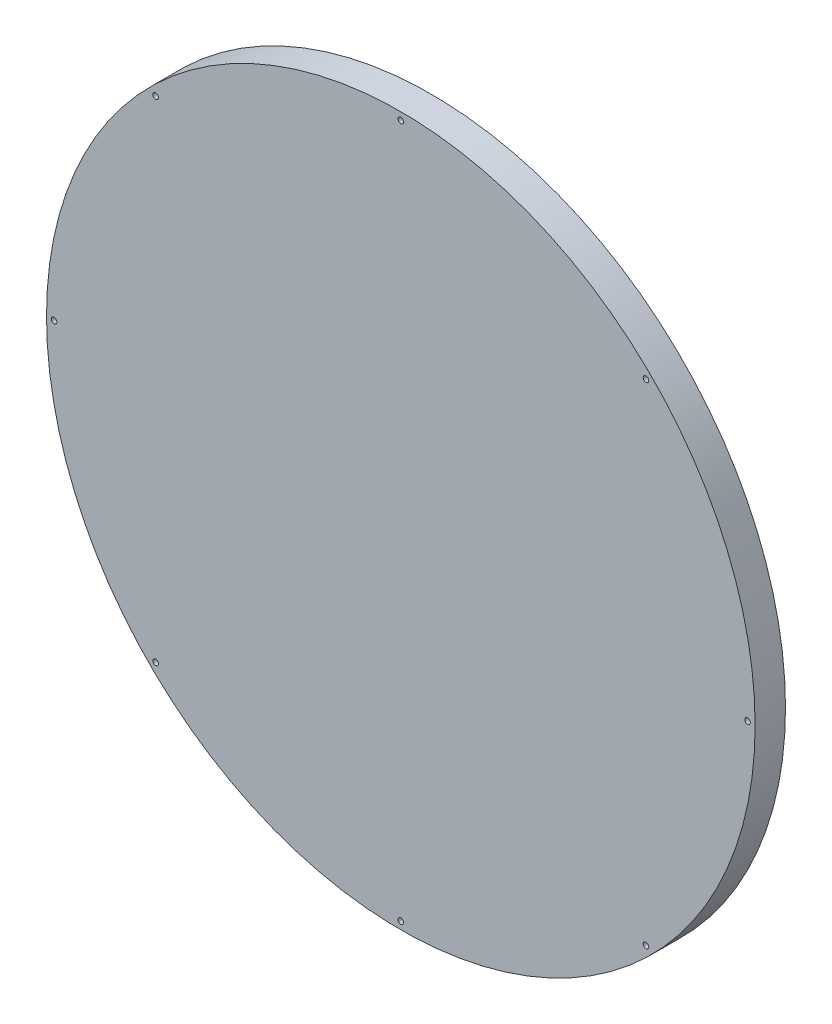
ISO-10303-21;
HEADER;
FILE_DESCRIPTION(('STEP AP214'),'2;1');
FILE_NAME('part.step','',(''),(''),'','','');
FILE_SCHEMA(('AUTOMOTIVE_DESIGN { 1 0 10303 214 1 1 1 1 }'));
ENDSEC;
DATA;
#1=APPLICATION_CONTEXT('core data for automotive mechanical design processes');
#2=APPLICATION_PROTOCOL_DEFINITION('international standard','automotive_design',2000,#1);
#3=PRODUCT_CONTEXT('',#1,'mechanical');
#4=PRODUCT('Part','Part','',(#3));
#5=PRODUCT_RELATED_PRODUCT_CATEGORY('part','',(#4));
#6=PRODUCT_DEFINITION_FORMATION('','',#4);
#7=PRODUCT_DEFINITION_CONTEXT('part definition',#1,'design');
#8=PRODUCT_DEFINITION('design','',#6,#7);
#9=PRODUCT_DEFINITION_SHAPE('','',#8);
#10=(LENGTH_UNIT() NAMED_UNIT(*) SI_UNIT(.MILLI.,.METRE.));
#11=(NAMED_UNIT(*) PLANE_ANGLE_UNIT() SI_UNIT($,.RADIAN.));
#12=(NAMED_UNIT(*) SI_UNIT($,.STERADIAN.) SOLID_ANGLE_UNIT());
#13=UNCERTAINTY_MEASURE_WITH_UNIT(LENGTH_MEASURE(1.E-05),#10,'distance_accuracy_value','');
#14=(GEOMETRIC_REPRESENTATION_CONTEXT(3) GLOBAL_UNCERTAINTY_ASSIGNED_CONTEXT((#13)) GLOBAL_UNIT_ASSIGNED_CONTEXT((#10,
#11,#12)) REPRESENTATION_CONTEXT('',''));
#15=CARTESIAN_POINT('',(0.,0.,0.));
#16=DIRECTION('',(0.,0.,1.));
#17=DIRECTION('',(1.,0.,0.));
#18=AXIS2_PLACEMENT_3D('',#15,#16,#17);
#19=CARTESIAN_POINT('',(0.,0.,12.));
#20=DIRECTION('',(0.,0.,-1.));
#21=DIRECTION('',(-1.,0.,0.));
#22=AXIS2_PLACEMENT_3D('',#19,#20,#21);
#23=CYLINDRICAL_SURFACE('',#22,140.);
#24=CARTESIAN_POINT('',(0.,0.,12.));
#25=DIRECTION('',(0.,0.,1.));
#26=DIRECTION('',(1.,0.,0.));
#27=AXIS2_PLACEMENT_3D('',#24,#25,#26);
#28=CIRCLE('',#27,140.);
#29=CARTESIAN_POINT('',(140.,0.,12.));
#30=VERTEX_POINT('',#29);
#31=EDGE_CURVE('E10',#30,#30,#28,.T.);
#32=ORIENTED_EDGE('',*,*,#31,.F.);
#33=EDGE_LOOP('',(#32));
#34=FACE_BOUND('',#33,.T.);
#35=CARTESIAN_POINT('',(0.,0.,0.));
#36=DIRECTION('',(0.,0.,1.));
#37=DIRECTION('',(1.,0.,0.));
#38=AXIS2_PLACEMENT_3D('',#35,#36,#37);
#39=CIRCLE('',#38,140.);
#40=CARTESIAN_POINT('',(140.,0.,0.));
#41=VERTEX_POINT('',#40);
#42=EDGE_CURVE('E40',#41,#41,#39,.T.);
#43=ORIENTED_EDGE('',*,*,#42,.T.);
#44=EDGE_LOOP('',(#43));
#45=FACE_BOUND('',#44,.T.);
#46=ADVANCED_FACE('F37',(#34,#45),#23,.T.);
#47=CARTESIAN_POINT('',(0.,0.,12.));
#48=DIRECTION('',(0.,0.,1.));
#49=DIRECTION('',(1.,0.,0.));
#50=AXIS2_PLACEMENT_3D('',#47,#48,#49);
#51=PLANE('',#50);
#52=CARTESIAN_POINT('',(0.,137.,12.));
#53=DIRECTION('',(0.,0.,-1.));
#54=DIRECTION('',(-1.,0.,0.));
#55=AXIS2_PLACEMENT_3D('',#52,#53,#54);
#56=CIRCLE('',#55,1.1);
#57=CARTESIAN_POINT('',(-1.1,137.,12.));
#58=VERTEX_POINT('',#57);
#59=EDGE_CURVE('E111',#58,#58,#56,.T.);
#60=ORIENTED_EDGE('',*,*,#59,.T.);
#61=EDGE_LOOP('',(#60));
#62=FACE_BOUND('',#61,.T.);
#63=CARTESIAN_POINT('',(-137.,0.,12.));
#64=DIRECTION('',(0.,0.,-1.));
#65=DIRECTION('',(-1.,0.,0.));
#66=AXIS2_PLACEMENT_3D('',#63,#64,#65);
#67=CIRCLE('',#66,1.09999999999999);
#68=CARTESIAN_POINT('',(-138.1,0.,12.));
#69=VERTEX_POINT('',#68);
#70=EDGE_CURVE('E102',#69,#69,#67,.T.);
#71=ORIENTED_EDGE('',*,*,#70,.T.);
#72=EDGE_LOOP('',(#71));
#73=FACE_BOUND('',#72,.T.);
#74=CARTESIAN_POINT('',(0.,-137.,12.));
#75=DIRECTION('',(0.,0.,-1.));
#76=DIRECTION('',(-1.,0.,0.));
#77=AXIS2_PLACEMENT_3D('',#74,#75,#76);
#78=CIRCLE('',#77,1.1);
#79=CARTESIAN_POINT('',(-1.1,-137.,12.));
#80=VERTEX_POINT('',#79);
#81=EDGE_CURVE('E93',#80,#80,#78,.T.);
#82=ORIENTED_EDGE('',*,*,#81,.T.);
#83=EDGE_LOOP('',(#82));
#84=FACE_BOUND('',#83,.T.);
#85=CARTESIAN_POINT('',(137.,0.,12.));
#86=DIRECTION('',(0.,0.,-1.));
#87=DIRECTION('',(-1.,0.,0.));
#88=AXIS2_PLACEMENT_3D('',#85,#86,#87);
#89=CIRCLE('',#88,1.09999999999999);
#90=CARTESIAN_POINT('',(135.9,0.,12.));
#91=VERTEX_POINT('',#90);
#92=EDGE_CURVE('E84',#91,#91,#89,.T.);
#93=ORIENTED_EDGE('',*,*,#92,.T.);
#94=EDGE_LOOP('',(#93));
#95=FACE_BOUND('',#94,.T.);
#96=CARTESIAN_POINT('',(96.874,96.874,12.));
#97=DIRECTION('',(0.,0.,-1.));
#98=DIRECTION('',(-1.,0.,0.));
#99=AXIS2_PLACEMENT_3D('',#96,#97,#98);
#100=CIRCLE('',#99,1.1);
#101=CARTESIAN_POINT('',(95.774,96.874,12.));
#102=VERTEX_POINT('',#101);
#103=EDGE_CURVE('E75',#102,#102,#100,.T.);
#104=ORIENTED_EDGE('',*,*,#103,.T.);
#105=EDGE_LOOP('',(#104));
#106=FACE_BOUND('',#105,.T.);
#107=CARTESIAN_POINT('',(-96.874,96.874,12.));
#108=DIRECTION('',(0.,0.,-1.));
#109=DIRECTION('',(-1.,0.,0.));
#110=AXIS2_PLACEMENT_3D('',#107,#108,#109);
#111=CIRCLE('',#110,1.1);
#112=CARTESIAN_POINT('',(-97.974,96.874,12.));
#113=VERTEX_POINT('',#112);
#114=EDGE_CURVE('E66',#113,#113,#111,.T.);
#115=ORIENTED_EDGE('',*,*,#114,.T.);
#116=EDGE_LOOP('',(#115));
#117=FACE_BOUND('',#116,.T.);
#118=CARTESIAN_POINT('',(-96.874,-96.874,12.));
#119=DIRECTION('',(0.,0.,-1.));
#120=DIRECTION('',(-1.,0.,0.));
#121=AXIS2_PLACEMENT_3D('',#118,#119,#120);
#122=CIRCLE('',#121,1.1);
#123=CARTESIAN_POINT('',(-97.974,-96.874,12.));
#124=VERTEX_POINT('',#123);
#125=EDGE_CURVE('E57',#124,#124,#122,.T.);
#126=ORIENTED_EDGE('',*,*,#125,.T.);
#127=EDGE_LOOP('',(#126));
#128=FACE_BOUND('',#127,.T.);
#129=CARTESIAN_POINT('',(96.874,-96.874,12.));
#130=DIRECTION('',(0.,0.,-1.));
#131=DIRECTION('',(-1.,0.,0.));
#132=AXIS2_PLACEMENT_3D('',#129,#130,#131);
#133=CIRCLE('',#132,1.1);
#134=CARTESIAN_POINT('',(95.774,-96.874,12.));
#135=VERTEX_POINT('',#134);
#136=EDGE_CURVE('E47',#135,#135,#133,.T.);
#137=ORIENTED_EDGE('',*,*,#136,.T.);
#138=EDGE_LOOP('',(#137));
#139=FACE_BOUND('',#138,.T.);
#140=ORIENTED_EDGE('',*,*,#31,.T.);
#141=EDGE_LOOP('',(#140));
#142=FACE_BOUND('',#141,.T.);
#143=ADVANCED_FACE('F127',(#62,#73,#84,#95,#106,#117,#128,#139,#142),#51,.T.);
#144=CARTESIAN_POINT('',(0.,0.,0.));
#145=DIRECTION('',(0.,0.,1.));
#146=DIRECTION('',(1.,0.,0.));
#147=AXIS2_PLACEMENT_3D('',#144,#145,#146);
#148=PLANE('',#147);
#149=CARTESIAN_POINT('',(0.,137.,0.));
#150=DIRECTION('',(0.,0.,-1.));
#151=DIRECTION('',(-1.,0.,0.));
#152=AXIS2_PLACEMENT_3D('',#149,#150,#151);
#153=CIRCLE('',#152,2.2);
#154=CARTESIAN_POINT('',(-2.2,137.,0.));
#155=VERTEX_POINT('',#154);
#156=EDGE_CURVE('E117',#155,#155,#153,.T.);
#157=ORIENTED_EDGE('',*,*,#156,.F.);
#158=EDGE_LOOP('',(#157));
#159=FACE_BOUND('',#158,.T.);
#160=CARTESIAN_POINT('',(-137.,0.,0.));
#161=DIRECTION('',(0.,0.,-1.));
#162=DIRECTION('',(-1.,0.,0.));
#163=AXIS2_PLACEMENT_3D('',#160,#161,#162);
#164=CIRCLE('',#163,2.20000000000001);
#165=CARTESIAN_POINT('',(-139.2,0.,0.));
#166=VERTEX_POINT('',#165);
#167=EDGE_CURVE('E108',#166,#166,#164,.T.);
#168=ORIENTED_EDGE('',*,*,#167,.F.);
#169=EDGE_LOOP('',(#168));
#170=FACE_BOUND('',#169,.T.);
#171=CARTESIAN_POINT('',(0.,-137.,0.));
#172=DIRECTION('',(0.,0.,-1.));
#173=DIRECTION('',(-1.,0.,0.));
#174=AXIS2_PLACEMENT_3D('',#171,#172,#173);
#175=CIRCLE('',#174,2.2);
#176=CARTESIAN_POINT('',(-2.2,-137.,0.));
#177=VERTEX_POINT('',#176);
#178=EDGE_CURVE('E99',#177,#177,#175,.T.);
#179=ORIENTED_EDGE('',*,*,#178,.F.);
#180=EDGE_LOOP('',(#179));
#181=FACE_BOUND('',#180,.T.);
#182=CARTESIAN_POINT('',(137.,0.,0.));
#183=DIRECTION('',(0.,0.,-1.));
#184=DIRECTION('',(-1.,0.,0.));
#185=AXIS2_PLACEMENT_3D('',#182,#183,#184);
#186=CIRCLE('',#185,2.20000000000001);
#187=CARTESIAN_POINT('',(134.8,0.,0.));
#188=VERTEX_POINT('',#187);
#189=EDGE_CURVE('E90',#188,#188,#186,.T.);
#190=ORIENTED_EDGE('',*,*,#189,.F.);
#191=EDGE_LOOP('',(#190));
#192=FACE_BOUND('',#191,.T.);
#193=CARTESIAN_POINT('',(96.874,96.874,0.));
#194=DIRECTION('',(0.,0.,-1.));
#195=DIRECTION('',(-1.,0.,0.));
#196=AXIS2_PLACEMENT_3D('',#193,#194,#195);
#197=CIRCLE('',#196,2.19999999999999);
#198=CARTESIAN_POINT('',(94.674,96.874,0.));
#199=VERTEX_POINT('',#198);
#200=EDGE_CURVE('E81',#199,#199,#197,.T.);
#201=ORIENTED_EDGE('',*,*,#200,.F.);
#202=EDGE_LOOP('',(#201));
#203=FACE_BOUND('',#202,.T.);
#204=CARTESIAN_POINT('',(-96.874,96.874,0.));
#205=DIRECTION('',(0.,0.,-1.));
#206=DIRECTION('',(-1.,0.,0.));
#207=AXIS2_PLACEMENT_3D('',#204,#205,#206);
#208=CIRCLE('',#207,2.19999999999999);
#209=CARTESIAN_POINT('',(-99.074,96.874,0.));
#210=VERTEX_POINT('',#209);
#211=EDGE_CURVE('E72',#210,#210,#208,.T.);
#212=ORIENTED_EDGE('',*,*,#211,.F.);
#213=EDGE_LOOP('',(#212));
#214=FACE_BOUND('',#213,.T.);
#215=CARTESIAN_POINT('',(-96.874,-96.874,0.));
#216=DIRECTION('',(0.,0.,-1.));
#217=DIRECTION('',(-1.,0.,0.));
#218=AXIS2_PLACEMENT_3D('',#215,#216,#217);
#219=CIRCLE('',#218,2.19999999999999);
#220=CARTESIAN_POINT('',(-99.074,-96.874,0.));
#221=VERTEX_POINT('',#220);
#222=EDGE_CURVE('E63',#221,#221,#219,.T.);
#223=ORIENTED_EDGE('',*,*,#222,.F.);
#224=EDGE_LOOP('',(#223));
#225=FACE_BOUND('',#224,.T.);
#226=CARTESIAN_POINT('',(96.874,-96.874,0.));
#227=DIRECTION('',(0.,0.,-1.));
#228=DIRECTION('',(-1.,0.,0.));
#229=AXIS2_PLACEMENT_3D('',#226,#227,#228);
#230=CIRCLE('',#229,2.19999999999999);
#231=CARTESIAN_POINT('',(94.674,-96.874,0.));
#232=VERTEX_POINT('',#231);
#233=EDGE_CURVE('E54',#232,#232,#230,.T.);
#234=ORIENTED_EDGE('',*,*,#233,.F.);
#235=EDGE_LOOP('',(#234));
#236=FACE_BOUND('',#235,.T.);
#237=ORIENTED_EDGE('',*,*,#42,.F.);
#238=EDGE_LOOP('',(#237));
#239=FACE_BOUND('',#238,.T.);
#240=ADVANCED_FACE('F123',(#159,#170,#181,#192,#203,#214,#225,#236,#239),#148,.F.);
#241=CARTESIAN_POINT('',(96.874,-96.874,0.));
#242=DIRECTION('',(0.,0.,-1.));
#243=DIRECTION('',(-1.,0.,0.));
#244=AXIS2_PLACEMENT_3D('',#241,#242,#243);
#245=CYLINDRICAL_SURFACE('',#244,1.1);
#246=ORIENTED_EDGE('',*,*,#136,.F.);
#247=EDGE_LOOP('',(#246));
#248=FACE_BOUND('',#247,.T.);
#249=CARTESIAN_POINT('',(96.874,-96.874,1.1));
#250=DIRECTION('',(0.,0.,-1.));
#251=DIRECTION('',(-1.,0.,0.));
#252=AXIS2_PLACEMENT_3D('',#249,#250,#251);
#253=CIRCLE('',#252,1.1);
#254=CARTESIAN_POINT('',(95.774,-96.874,1.1));
#255=VERTEX_POINT('',#254);
#256=EDGE_CURVE('E51',#255,#255,#253,.T.);
#257=ORIENTED_EDGE('',*,*,#256,.T.);
#258=EDGE_LOOP('',(#257));
#259=FACE_BOUND('',#258,.T.);
#260=ADVANCED_FACE('F126',(#248,#259),#245,.F.);
#261=CARTESIAN_POINT('',(96.874,-96.874,0.));
#262=DIRECTION('',(0.,0.,-1.));
#263=DIRECTION('',(-1.,0.,0.));
#264=AXIS2_PLACEMENT_3D('',#261,#262,#263);
#265=CONICAL_SURFACE('',#264,2.19999999999999,0.785398163397443);
#266=ORIENTED_EDGE('',*,*,#256,.F.);
#267=EDGE_LOOP('',(#266));
#268=FACE_BOUND('',#267,.T.);
#269=ORIENTED_EDGE('',*,*,#233,.T.);
#270=EDGE_LOOP('',(#269));
#271=FACE_BOUND('',#270,.T.);
#272=ADVANCED_FACE('F157',(#268,#271),#265,.F.);
#273=CARTESIAN_POINT('',(-96.874,-96.874,0.));
#274=DIRECTION('',(0.,0.,-1.));
#275=DIRECTION('',(-1.,0.,0.));
#276=AXIS2_PLACEMENT_3D('',#273,#274,#275);
#277=CYLINDRICAL_SURFACE('',#276,1.1);
#278=ORIENTED_EDGE('',*,*,#125,.F.);
#279=EDGE_LOOP('',(#278));
#280=FACE_BOUND('',#279,.T.);
#281=CARTESIAN_POINT('',(-96.874,-96.874,1.1));
#282=DIRECTION('',(0.,0.,-1.));
#283=DIRECTION('',(-1.,0.,0.));
#284=AXIS2_PLACEMENT_3D('',#281,#282,#283);
#285=CIRCLE('',#284,1.1);
#286=CARTESIAN_POINT('',(-97.974,-96.874,1.1));
#287=VERTEX_POINT('',#286);
#288=EDGE_CURVE('E60',#287,#287,#285,.T.);
#289=ORIENTED_EDGE('',*,*,#288,.T.);
#290=EDGE_LOOP('',(#289));
#291=FACE_BOUND('',#290,.T.);
#292=ADVANCED_FACE('F161',(#280,#291),#277,.F.);
#293=CARTESIAN_POINT('',(-96.874,-96.874,0.));
#294=DIRECTION('',(0.,0.,-1.));
#295=DIRECTION('',(-1.,0.,0.));
#296=AXIS2_PLACEMENT_3D('',#293,#294,#295);
#297=CONICAL_SURFACE('',#296,2.19999999999999,0.785398163397443);
#298=ORIENTED_EDGE('',*,*,#288,.F.);
#299=EDGE_LOOP('',(#298));
#300=FACE_BOUND('',#299,.T.);
#301=ORIENTED_EDGE('',*,*,#222,.T.);
#302=EDGE_LOOP('',(#301));
#303=FACE_BOUND('',#302,.T.);
#304=ADVANCED_FACE('F165',(#300,#303),#297,.F.);
#305=CARTESIAN_POINT('',(-96.874,96.874,0.));
#306=DIRECTION('',(0.,0.,-1.));
#307=DIRECTION('',(-1.,0.,0.));
#308=AXIS2_PLACEMENT_3D('',#305,#306,#307);
#309=CYLINDRICAL_SURFACE('',#308,1.1);
#310=ORIENTED_EDGE('',*,*,#114,.F.);
#311=EDGE_LOOP('',(#310));
#312=FACE_BOUND('',#311,.T.);
#313=CARTESIAN_POINT('',(-96.874,96.874,1.1));
#314=DIRECTION('',(0.,0.,-1.));
#315=DIRECTION('',(-1.,0.,0.));
#316=AXIS2_PLACEMENT_3D('',#313,#314,#315);
#317=CIRCLE('',#316,1.1);
#318=CARTESIAN_POINT('',(-97.974,96.874,1.1));
#319=VERTEX_POINT('',#318);
#320=EDGE_CURVE('E69',#319,#319,#317,.T.);
#321=ORIENTED_EDGE('',*,*,#320,.T.);
#322=EDGE_LOOP('',(#321));
#323=FACE_BOUND('',#322,.T.);
#324=ADVANCED_FACE('F169',(#312,#323),#309,.F.);
#325=CARTESIAN_POINT('',(-96.874,96.874,0.));
#326=DIRECTION('',(0.,0.,-1.));
#327=DIRECTION('',(-1.,0.,0.));
#328=AXIS2_PLACEMENT_3D('',#325,#326,#327);
#329=CONICAL_SURFACE('',#328,2.19999999999999,0.785398163397443);
#330=ORIENTED_EDGE('',*,*,#320,.F.);
#331=EDGE_LOOP('',(#330));
#332=FACE_BOUND('',#331,.T.);
#333=ORIENTED_EDGE('',*,*,#211,.T.);
#334=EDGE_LOOP('',(#333));
#335=FACE_BOUND('',#334,.T.);
#336=ADVANCED_FACE('F173',(#332,#335),#329,.F.);
#337=CARTESIAN_POINT('',(96.874,96.874,0.));
#338=DIRECTION('',(0.,0.,-1.));
#339=DIRECTION('',(-1.,0.,0.));
#340=AXIS2_PLACEMENT_3D('',#337,#338,#339);
#341=CYLINDRICAL_SURFACE('',#340,1.1);
#342=ORIENTED_EDGE('',*,*,#103,.F.);
#343=EDGE_LOOP('',(#342));
#344=FACE_BOUND('',#343,.T.);
#345=CARTESIAN_POINT('',(96.874,96.874,1.1));
#346=DIRECTION('',(0.,0.,-1.));
#347=DIRECTION('',(-1.,0.,0.));
#348=AXIS2_PLACEMENT_3D('',#345,#346,#347);
#349=CIRCLE('',#348,1.1);
#350=CARTESIAN_POINT('',(95.774,96.874,1.1));
#351=VERTEX_POINT('',#350);
#352=EDGE_CURVE('E78',#351,#351,#349,.T.);
#353=ORIENTED_EDGE('',*,*,#352,.T.);
#354=EDGE_LOOP('',(#353));
#355=FACE_BOUND('',#354,.T.);
#356=ADVANCED_FACE('F177',(#344,#355),#341,.F.);
#357=CARTESIAN_POINT('',(96.874,96.874,0.));
#358=DIRECTION('',(0.,0.,-1.));
#359=DIRECTION('',(-1.,0.,0.));
#360=AXIS2_PLACEMENT_3D('',#357,#358,#359);
#361=CONICAL_SURFACE('',#360,2.19999999999999,0.785398163397443);
#362=ORIENTED_EDGE('',*,*,#352,.F.);
#363=EDGE_LOOP('',(#362));
#364=FACE_BOUND('',#363,.T.);
#365=ORIENTED_EDGE('',*,*,#200,.T.);
#366=EDGE_LOOP('',(#365));
#367=FACE_BOUND('',#366,.T.);
#368=ADVANCED_FACE('F181',(#364,#367),#361,.F.);
#369=CARTESIAN_POINT('',(137.,0.,0.));
#370=DIRECTION('',(0.,0.,-1.));
#371=DIRECTION('',(-1.,0.,0.));
#372=AXIS2_PLACEMENT_3D('',#369,#370,#371);
#373=CYLINDRICAL_SURFACE('',#372,1.09999999999999);
#374=ORIENTED_EDGE('',*,*,#92,.F.);
#375=EDGE_LOOP('',(#374));
#376=FACE_BOUND('',#375,.T.);
#377=CARTESIAN_POINT('',(137.,0.,1.1));
#378=DIRECTION('',(0.,0.,-1.));
#379=DIRECTION('',(-1.,0.,0.));
#380=AXIS2_PLACEMENT_3D('',#377,#378,#379);
#381=CIRCLE('',#380,1.09999999999999);
#382=CARTESIAN_POINT('',(135.9,0.,1.1));
#383=VERTEX_POINT('',#382);
#384=EDGE_CURVE('E87',#383,#383,#381,.T.);
#385=ORIENTED_EDGE('',*,*,#384,.T.);
#386=EDGE_LOOP('',(#385));
#387=FACE_BOUND('',#386,.T.);
#388=ADVANCED_FACE('F185',(#376,#387),#373,.F.);
#389=CARTESIAN_POINT('',(137.,0.,0.));
#390=DIRECTION('',(0.,0.,-1.));
#391=DIRECTION('',(-1.,0.,0.));
#392=AXIS2_PLACEMENT_3D('',#389,#390,#391);
#393=CONICAL_SURFACE('',#392,2.20000000000001,0.785398163397455);
#394=ORIENTED_EDGE('',*,*,#384,.F.);
#395=EDGE_LOOP('',(#394));
#396=FACE_BOUND('',#395,.T.);
#397=ORIENTED_EDGE('',*,*,#189,.T.);
#398=EDGE_LOOP('',(#397));
#399=FACE_BOUND('',#398,.T.);
#400=ADVANCED_FACE('F189',(#396,#399),#393,.F.);
#401=CARTESIAN_POINT('',(0.,-137.,0.));
#402=DIRECTION('',(0.,0.,-1.));
#403=DIRECTION('',(-1.,0.,0.));
#404=AXIS2_PLACEMENT_3D('',#401,#402,#403);
#405=CYLINDRICAL_SURFACE('',#404,1.1);
#406=ORIENTED_EDGE('',*,*,#81,.F.);
#407=EDGE_LOOP('',(#406));
#408=FACE_BOUND('',#407,.T.);
#409=CARTESIAN_POINT('',(0.,-137.,1.1));
#410=DIRECTION('',(0.,0.,-1.));
#411=DIRECTION('',(-1.,0.,0.));
#412=AXIS2_PLACEMENT_3D('',#409,#410,#411);
#413=CIRCLE('',#412,1.1);
#414=CARTESIAN_POINT('',(-1.1,-137.,1.1));
#415=VERTEX_POINT('',#414);
#416=EDGE_CURVE('E96',#415,#415,#413,.T.);
#417=ORIENTED_EDGE('',*,*,#416,.T.);
#418=EDGE_LOOP('',(#417));
#419=FACE_BOUND('',#418,.T.);
#420=ADVANCED_FACE('F193',(#408,#419),#405,.F.);
#421=CARTESIAN_POINT('',(0.,-137.,0.));
#422=DIRECTION('',(0.,0.,-1.));
#423=DIRECTION('',(-1.,0.,0.));
#424=AXIS2_PLACEMENT_3D('',#421,#422,#423);
#425=CONICAL_SURFACE('',#424,2.2,0.785398163397448);
#426=ORIENTED_EDGE('',*,*,#416,.F.);
#427=EDGE_LOOP('',(#426));
#428=FACE_BOUND('',#427,.T.);
#429=ORIENTED_EDGE('',*,*,#178,.T.);
#430=EDGE_LOOP('',(#429));
#431=FACE_BOUND('',#430,.T.);
#432=ADVANCED_FACE('F197',(#428,#431),#425,.F.);
#433=CARTESIAN_POINT('',(-137.,0.,0.));
#434=DIRECTION('',(0.,0.,-1.));
#435=DIRECTION('',(-1.,0.,0.));
#436=AXIS2_PLACEMENT_3D('',#433,#434,#435);
#437=CYLINDRICAL_SURFACE('',#436,1.09999999999999);
#438=ORIENTED_EDGE('',*,*,#70,.F.);
#439=EDGE_LOOP('',(#438));
#440=FACE_BOUND('',#439,.T.);
#441=CARTESIAN_POINT('',(-137.,0.,1.1));
#442=DIRECTION('',(0.,0.,-1.));
#443=DIRECTION('',(-1.,0.,0.));
#444=AXIS2_PLACEMENT_3D('',#441,#442,#443);
#445=CIRCLE('',#444,1.09999999999999);
#446=CARTESIAN_POINT('',(-138.1,0.,1.1));
#447=VERTEX_POINT('',#446);
#448=EDGE_CURVE('E105',#447,#447,#445,.T.);
#449=ORIENTED_EDGE('',*,*,#448,.T.);
#450=EDGE_LOOP('',(#449));
#451=FACE_BOUND('',#450,.T.);
#452=ADVANCED_FACE('F201',(#440,#451),#437,.F.);
#453=CARTESIAN_POINT('',(-137.,0.,0.));
#454=DIRECTION('',(0.,0.,-1.));
#455=DIRECTION('',(-1.,0.,0.));
#456=AXIS2_PLACEMENT_3D('',#453,#454,#455);
#457=CONICAL_SURFACE('',#456,2.20000000000001,0.785398163397455);
#458=ORIENTED_EDGE('',*,*,#448,.F.);
#459=EDGE_LOOP('',(#458));
#460=FACE_BOUND('',#459,.T.);
#461=ORIENTED_EDGE('',*,*,#167,.T.);
#462=EDGE_LOOP('',(#461));
#463=FACE_BOUND('',#462,.T.);
#464=ADVANCED_FACE('F205',(#460,#463),#457,.F.);
#465=CARTESIAN_POINT('',(0.,137.,0.));
#466=DIRECTION('',(0.,0.,-1.));
#467=DIRECTION('',(-1.,0.,0.));
#468=AXIS2_PLACEMENT_3D('',#465,#466,#467);
#469=CYLINDRICAL_SURFACE('',#468,1.1);
#470=ORIENTED_EDGE('',*,*,#59,.F.);
#471=EDGE_LOOP('',(#470));
#472=FACE_BOUND('',#471,.T.);
#473=CARTESIAN_POINT('',(0.,137.,1.1));
#474=DIRECTION('',(0.,0.,-1.));
#475=DIRECTION('',(-1.,0.,0.));
#476=AXIS2_PLACEMENT_3D('',#473,#474,#475);
#477=CIRCLE('',#476,1.1);
#478=CARTESIAN_POINT('',(-1.1,137.,1.1));
#479=VERTEX_POINT('',#478);
#480=EDGE_CURVE('E114',#479,#479,#477,.T.);
#481=ORIENTED_EDGE('',*,*,#480,.T.);
#482=EDGE_LOOP('',(#481));
#483=FACE_BOUND('',#482,.T.);
#484=ADVANCED_FACE('F209',(#472,#483),#469,.F.);
#485=CARTESIAN_POINT('',(0.,137.,0.));
#486=DIRECTION('',(0.,0.,-1.));
#487=DIRECTION('',(-1.,0.,0.));
#488=AXIS2_PLACEMENT_3D('',#485,#486,#487);
#489=CONICAL_SURFACE('',#488,2.2,0.785398163397448);
#490=ORIENTED_EDGE('',*,*,#480,.F.);
#491=EDGE_LOOP('',(#490));
#492=FACE_BOUND('',#491,.T.);
#493=ORIENTED_EDGE('',*,*,#156,.T.);
#494=EDGE_LOOP('',(#493));
#495=FACE_BOUND('',#494,.T.);
#496=ADVANCED_FACE('F121',(#492,#495),#489,.F.);
#497=CLOSED_SHELL('',(#46,#143,#240,#260,#272,#292,#304,#324,#336,#356,#368,#388,#400,#420,#432,
#452,#464,#484,#496));
#498=MANIFOLD_SOLID_BREP('B2',#497);
#499=ADVANCED_BREP_SHAPE_REPRESENTATION('',(#18,#498),#14);
#500=SHAPE_DEFINITION_REPRESENTATION(#9,#499);
ENDSEC;
END-ISO-10303-21;
